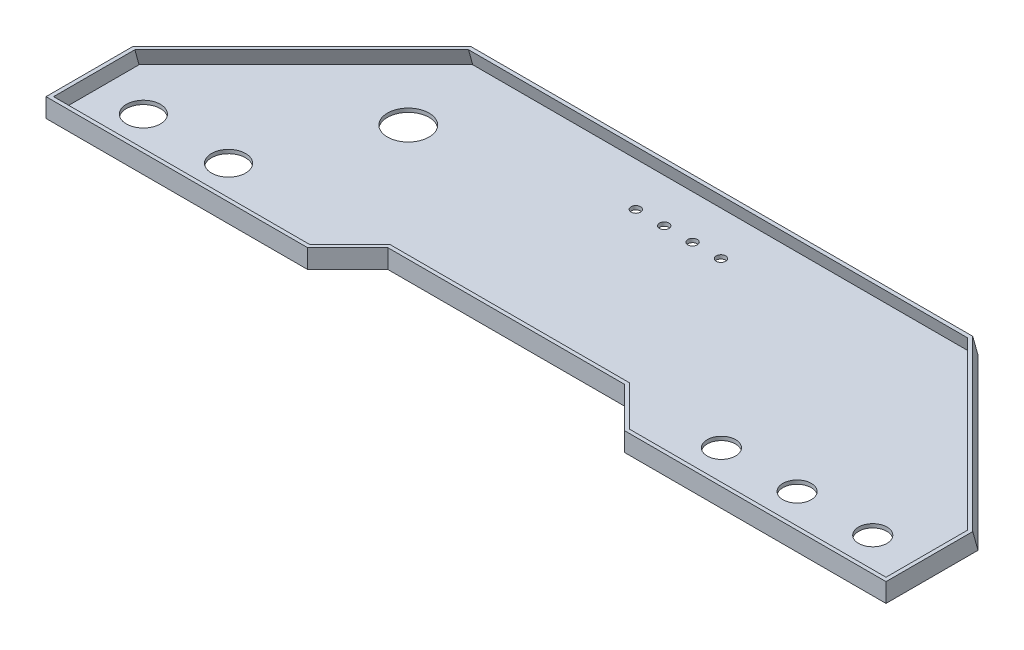
ISO-10303-21;
HEADER;
FILE_DESCRIPTION(('STEP AP214'),'2;1');
FILE_NAME('part.step','',(''),(''),'','','');
FILE_SCHEMA(('AUTOMOTIVE_DESIGN { 1 0 10303 214 1 1 1 1 }'));
ENDSEC;
DATA;
#1=APPLICATION_CONTEXT('core data for automotive mechanical design processes');
#2=APPLICATION_PROTOCOL_DEFINITION('international standard','automotive_design',2000,#1);
#3=PRODUCT_CONTEXT('',#1,'mechanical');
#4=PRODUCT('Part','Part','',(#3));
#5=PRODUCT_RELATED_PRODUCT_CATEGORY('part','',(#4));
#6=PRODUCT_DEFINITION_FORMATION('','',#4);
#7=PRODUCT_DEFINITION_CONTEXT('part definition',#1,'design');
#8=PRODUCT_DEFINITION('design','',#6,#7);
#9=PRODUCT_DEFINITION_SHAPE('','',#8);
#10=(LENGTH_UNIT() NAMED_UNIT(*) SI_UNIT(.MILLI.,.METRE.));
#11=(NAMED_UNIT(*) PLANE_ANGLE_UNIT() SI_UNIT($,.RADIAN.));
#12=(NAMED_UNIT(*) SI_UNIT($,.STERADIAN.) SOLID_ANGLE_UNIT());
#13=UNCERTAINTY_MEASURE_WITH_UNIT(LENGTH_MEASURE(1.E-05),#10,'distance_accuracy_value','');
#14=(GEOMETRIC_REPRESENTATION_CONTEXT(3) GLOBAL_UNCERTAINTY_ASSIGNED_CONTEXT((#13)) GLOBAL_UNIT_ASSIGNED_CONTEXT((#10,
#11,#12)) REPRESENTATION_CONTEXT('',''));
#15=CARTESIAN_POINT('',(0.,0.,0.));
#16=DIRECTION('',(0.,0.,1.));
#17=DIRECTION('',(1.,0.,0.));
#18=AXIS2_PLACEMENT_3D('',#15,#16,#17);
#19=CARTESIAN_POINT('',(0.,10.,0.));
#20=DIRECTION('',(0.,1.,0.));
#21=DIRECTION('',(0.,0.,1.));
#22=AXIS2_PLACEMENT_3D('',#19,#20,#21);
#23=PLANE('',#22);
#24=DIRECTION('',(1.,0.,0.));
#25=VECTOR('',#24,1.);
#26=CARTESIAN_POINT('',(0.,10.,142.));
#27=LINE('',#26,#25);
#28=CARTESIAN_POINT('',(-219.999999994777,10.,142.));
#29=VERTEX_POINT('',#28);
#30=CARTESIAN_POINT('',(-84.5269119206043,10.,142.));
#31=VERTEX_POINT('',#30);
#32=EDGE_CURVE('E236',#29,#31,#27,.T.);
#33=ORIENTED_EDGE('',*,*,#32,.F.);
#34=DIRECTION('',(0.,0.,1.));
#35=VECTOR('',#34,1.);
#36=CARTESIAN_POINT('',(-219.999999994777,10.,0.));
#37=LINE('',#36,#35);
#38=CARTESIAN_POINT('',(-219.999999994777,10.,99.0317101084428));
#39=VERTEX_POINT('',#38);
#40=EDGE_CURVE('E258',#39,#29,#37,.T.);
#41=ORIENTED_EDGE('',*,*,#40,.F.);
#42=DIRECTION('',(-0.707106781166289,0.,0.707106781206806));
#43=VECTOR('',#42,1.);
#44=CARTESIAN_POINT('',(-60.48414494947,10.,-60.4841449460043));
#45=LINE('',#44,#43);
#46=CARTESIAN_POINT('',(-131.820656156528,10.,10.8523662651414));
#47=VERTEX_POINT('',#46);
#48=EDGE_CURVE('E72',#47,#39,#45,.T.);
#49=ORIENTED_EDGE('',*,*,#48,.F.);
#50=DIRECTION('',(-1.,0.,0.));
#51=VECTOR('',#50,1.);
#52=CARTESIAN_POINT('',(0.,10.,10.8523662651414));
#53=LINE('',#52,#51);
#54=CARTESIAN_POINT('',(131.820656169937,10.,10.8523662651414));
#55=VERTEX_POINT('',#54);
#56=EDGE_CURVE('E255',#55,#47,#53,.T.);
#57=ORIENTED_EDGE('',*,*,#56,.F.);
#58=DIRECTION('',(-0.707106781186556,0.,-0.707106781186539));
#59=VECTOR('',#58,1.);
#60=CARTESIAN_POINT('',(60.4841449523962,10.,-60.4841449523977));
#61=LINE('',#60,#59);
#62=CARTESIAN_POINT('',(220.000000010123,10.,99.0317101053249));
#63=VERTEX_POINT('',#62);
#64=EDGE_CURVE('E218',#63,#55,#61,.T.);
#65=ORIENTED_EDGE('',*,*,#64,.F.);
#66=DIRECTION('',(0.,0.,-1.));
#67=VECTOR('',#66,1.);
#68=CARTESIAN_POINT('',(220.000000010123,10.,0.));
#69=LINE('',#68,#67);
#70=CARTESIAN_POINT('',(220.000000010123,10.,141.999999994878));
#71=VERTEX_POINT('',#70);
#72=EDGE_CURVE('E251',#71,#63,#69,.T.);
#73=ORIENTED_EDGE('',*,*,#72,.F.);
#74=DIRECTION('',(1.,0.,0.));
#75=VECTOR('',#74,1.);
#76=CARTESIAN_POINT('',(0.,10.,141.999999994878));
#77=LINE('',#76,#75);
#78=CARTESIAN_POINT('',(84.5269119413094,10.,141.999999994878));
#79=VERTEX_POINT('',#78);
#80=EDGE_CURVE('E248',#79,#71,#77,.T.);
#81=ORIENTED_EDGE('',*,*,#80,.F.);
#82=DIRECTION('',(0.707106780974023,0.,0.707106781399072));
#83=VECTOR('',#82,1.);
#84=CARTESIAN_POINT('',(-28.7365440013794,10.,28.7365439841055));
#85=LINE('',#84,#83);
#86=CARTESIAN_POINT('',(63.3137085094821,10.,120.786796550299));
#87=VERTEX_POINT('',#86);
#88=EDGE_CURVE('E245',#87,#79,#85,.T.);
#89=ORIENTED_EDGE('',*,*,#88,.F.);
#90=DIRECTION('',(1.,0.,-6.11336731652061E-11));
#91=VECTOR('',#90,1.);
#92=CARTESIAN_POINT('',(7.38414054321486E-09,10.,120.78679655417));
#93=LINE('',#92,#91);
#94=CARTESIAN_POINT('',(-63.3137084812384,10.,120.78679655804));
#95=VERTEX_POINT('',#94);
#96=EDGE_CURVE('E242',#95,#87,#93,.T.);
#97=ORIENTED_EDGE('',*,*,#96,.F.);
#98=DIRECTION('',(0.707106781143319,0.,-0.707106781229776));
#99=VECTOR('',#98,1.);
#100=CARTESIAN_POINT('',(28.7365440345304,10.,28.7365440310167));
#101=LINE('',#100,#99);
#102=EDGE_CURVE('E239',#31,#95,#101,.T.);
#103=ORIENTED_EDGE('',*,*,#102,.F.);
#104=EDGE_LOOP('',(#33,#41,#49,#57,#65,#73,#81,#89,#97,#103));
#105=FACE_BOUND('',#104,.T.);
#106=DIRECTION('',(1.,0.,0.));
#107=VECTOR('',#106,1.);
#108=CARTESIAN_POINT('',(-221.999999994777,10.,144.));
#109=LINE('',#108,#107);
#110=CARTESIAN_POINT('',(-221.999999994777,10.,144.));
#111=VERTEX_POINT('',#110);
#112=CARTESIAN_POINT('',(-83.6984847944896,10.,144.));
#113=VERTEX_POINT('',#112);
#114=EDGE_CURVE('E558',#111,#113,#109,.T.);
#115=ORIENTED_EDGE('',*,*,#114,.T.);
#116=DIRECTION('',(0.70710678110009,0.,-0.707106781273005));
#117=VECTOR('',#116,1.);
#118=CARTESIAN_POINT('',(-83.6984847944896,10.,144.));
#119=LINE('',#118,#117);
#120=CARTESIAN_POINT('',(-62.4852813614867,10.,122.78679656181));
#121=VERTEX_POINT('',#120);
#122=EDGE_CURVE('E549',#113,#121,#119,.T.);
#123=ORIENTED_EDGE('',*,*,#122,.T.);
#124=DIRECTION('',(1.,0.,-1.22267346330412E-10));
#125=VECTOR('',#124,1.);
#126=CARTESIAN_POINT('',(-62.4852813614867,10.,122.78679656181));
#127=LINE('',#126,#125);
#128=CARTESIAN_POINT('',(62.4852813869902,10.,122.78679654653));
#129=VERTEX_POINT('',#128);
#130=EDGE_CURVE('E540',#121,#129,#127,.T.);
#131=ORIENTED_EDGE('',*,*,#130,.T.);
#132=DIRECTION('',(0.707106780761499,0.,0.707106781611596));
#133=VECTOR('',#132,1.);
#134=CARTESIAN_POINT('',(62.4852813869902,10.,122.78679654653));
#135=LINE('',#134,#133);
#136=CARTESIAN_POINT('',(83.6984848098353,10.,143.999999994878));
#137=VERTEX_POINT('',#136);
#138=EDGE_CURVE('E532',#129,#137,#135,.T.);
#139=ORIENTED_EDGE('',*,*,#138,.T.);
#140=DIRECTION('',(1.,0.,0.));
#141=VECTOR('',#140,1.);
#142=CARTESIAN_POINT('',(83.6984848098353,10.,143.999999994878));
#143=LINE('',#142,#141);
#144=CARTESIAN_POINT('',(222.000000010123,10.,143.999999994878));
#145=VERTEX_POINT('',#144);
#146=EDGE_CURVE('E443',#137,#145,#143,.T.);
#147=ORIENTED_EDGE('',*,*,#146,.T.);
#148=DIRECTION('',(0.,0.,-1.));
#149=VECTOR('',#148,1.);
#150=CARTESIAN_POINT('',(222.000000010123,10.,143.999999994878));
#151=LINE('',#150,#149);
#152=CARTESIAN_POINT('',(222.000000010123,10.,98.1492802448776));
#153=VERTEX_POINT('',#152);
#154=EDGE_CURVE('E487',#145,#153,#151,.T.);
#155=ORIENTED_EDGE('',*,*,#154,.T.);
#156=DIRECTION('',(-0.707106781186556,0.,-0.707106781186539));
#157=VECTOR('',#156,1.);
#158=CARTESIAN_POINT('',(132.627417005112,10.,8.77669723986886));
#159=LINE('',#158,#157);
#160=CARTESIAN_POINT('',(132.627417005112,10.,8.77669723986886));
#161=VERTEX_POINT('',#160);
#162=EDGE_CURVE('E500',#153,#161,#159,.T.);
#163=ORIENTED_EDGE('',*,*,#162,.T.);
#164=DIRECTION('',(-1.,0.,0.));
#165=VECTOR('',#164,1.);
#166=CARTESIAN_POINT('',(132.627417005112,10.,8.77669723986886));
#167=LINE('',#166,#165);
#168=CARTESIAN_POINT('',(-132.627416994888,10.,8.77669723986889));
#169=VERTEX_POINT('',#168);
#170=EDGE_CURVE('E510',#161,#169,#167,.T.);
#171=ORIENTED_EDGE('',*,*,#170,.T.);
#172=DIRECTION('',(-0.707106781146031,0.,0.707106781227065));
#173=VECTOR('',#172,1.);
#174=CARTESIAN_POINT('',(-132.627416994888,10.,8.77669723986889));
#175=LINE('',#174,#173);
#176=CARTESIAN_POINT('',(-221.999999994777,10.,98.1492802499997));
#177=VERTEX_POINT('',#176);
#178=EDGE_CURVE('E64',#169,#177,#175,.T.);
#179=ORIENTED_EDGE('',*,*,#178,.T.);
#180=DIRECTION('',(0.,0.,1.));
#181=VECTOR('',#180,1.);
#182=CARTESIAN_POINT('',(-221.999999994777,10.,144.));
#183=LINE('',#182,#181);
#184=EDGE_CURVE('E12',#177,#111,#183,.T.);
#185=ORIENTED_EDGE('',*,*,#184,.T.);
#186=EDGE_LOOP('',(#115,#123,#131,#139,#147,#155,#163,#171,#179,#185));
#187=FACE_BOUND('',#186,.T.);
#188=ADVANCED_FACE('F55',(#105,#187),#23,.T.);
#189=CARTESIAN_POINT('',(0.,0.,0.));
#190=DIRECTION('',(0.,1.,0.));
#191=DIRECTION('',(0.,0.,1.));
#192=AXIS2_PLACEMENT_3D('',#189,#190,#191);
#193=PLANE('',#192);
#194=CARTESIAN_POINT('',(-151.259999994777,0.,118.26));
#195=DIRECTION('',(0.,-1.,0.));
#196=DIRECTION('',(0.,0.,-1.));
#197=AXIS2_PLACEMENT_3D('',#194,#195,#196);
#198=CIRCLE('',#197,9.00000000000001);
#199=CARTESIAN_POINT('',(-151.259999994777,0.,109.26));
#200=VERTEX_POINT('',#199);
#201=EDGE_CURVE('E909',#200,#200,#198,.T.);
#202=ORIENTED_EDGE('',*,*,#201,.F.);
#203=EDGE_LOOP('',(#202));
#204=FACE_BOUND('',#203,.T.);
#205=CARTESIAN_POINT('',(-196.259999994777,0.,118.26));
#206=DIRECTION('',(0.,-1.,0.));
#207=DIRECTION('',(0.,0.,-1.));
#208=AXIS2_PLACEMENT_3D('',#205,#206,#207);
#209=CIRCLE('',#208,9.00000000000001);
#210=CARTESIAN_POINT('',(-196.259999994777,0.,109.26));
#211=VERTEX_POINT('',#210);
#212=EDGE_CURVE('E911',#211,#211,#209,.T.);
#213=ORIENTED_EDGE('',*,*,#212,.F.);
#214=EDGE_LOOP('',(#213));
#215=FACE_BOUND('',#214,.T.);
#216=CARTESIAN_POINT('',(-121.259999994777,0.,53.2600000000001));
#217=DIRECTION('',(0.,-1.,0.));
#218=DIRECTION('',(0.,0.,-1.));
#219=AXIS2_PLACEMENT_3D('',#216,#217,#218);
#220=CIRCLE('',#219,11.);
#221=CARTESIAN_POINT('',(-121.259999994777,0.,42.2600000000001));
#222=VERTEX_POINT('',#221);
#223=EDGE_CURVE('E917',#222,#222,#220,.T.);
#224=ORIENTED_EDGE('',*,*,#223,.F.);
#225=EDGE_LOOP('',(#224));
#226=FACE_BOUND('',#225,.T.);
#227=CARTESIAN_POINT('',(109.259999994777,0.,118.26));
#228=DIRECTION('',(0.,-1.,0.));
#229=DIRECTION('',(0.,0.,-1.));
#230=AXIS2_PLACEMENT_3D('',#227,#228,#229);
#231=CIRCLE('',#230,7.50000000000001);
#232=CARTESIAN_POINT('',(109.259999994777,0.,110.76));
#233=VERTEX_POINT('',#232);
#234=EDGE_CURVE('E910',#233,#233,#231,.T.);
#235=ORIENTED_EDGE('',*,*,#234,.F.);
#236=EDGE_LOOP('',(#235));
#237=FACE_BOUND('',#236,.T.);
#238=CARTESIAN_POINT('',(149.259999994777,0.,118.26));
#239=DIRECTION('',(0.,-1.,0.));
#240=DIRECTION('',(0.,0.,-1.));
#241=AXIS2_PLACEMENT_3D('',#238,#239,#240);
#242=CIRCLE('',#241,7.50000000000001);
#243=CARTESIAN_POINT('',(149.259999994777,0.,110.76));
#244=VERTEX_POINT('',#243);
#245=EDGE_CURVE('E914',#244,#244,#242,.T.);
#246=ORIENTED_EDGE('',*,*,#245,.F.);
#247=EDGE_LOOP('',(#246));
#248=FACE_BOUND('',#247,.T.);
#249=CARTESIAN_POINT('',(7.5,0.,31.74));
#250=DIRECTION('',(0.,-1.,0.));
#251=DIRECTION('',(0.,0.,-1.));
#252=AXIS2_PLACEMENT_3D('',#249,#250,#251);
#253=CIRCLE('',#252,2.5);
#254=CARTESIAN_POINT('',(7.5,0.,29.24));
#255=VERTEX_POINT('',#254);
#256=EDGE_CURVE('E579',#255,#255,#253,.T.);
#257=ORIENTED_EDGE('',*,*,#256,.F.);
#258=EDGE_LOOP('',(#257));
#259=FACE_BOUND('',#258,.T.);
#260=CARTESIAN_POINT('',(-7.5,0.,31.74));
#261=DIRECTION('',(0.,-1.,0.));
#262=DIRECTION('',(0.,0.,-1.));
#263=AXIS2_PLACEMENT_3D('',#260,#261,#262);
#264=CIRCLE('',#263,2.5);
#265=CARTESIAN_POINT('',(-7.5,0.,29.24));
#266=VERTEX_POINT('',#265);
#267=EDGE_CURVE('E609',#266,#266,#264,.T.);
#268=ORIENTED_EDGE('',*,*,#267,.F.);
#269=EDGE_LOOP('',(#268));
#270=FACE_BOUND('',#269,.T.);
#271=CARTESIAN_POINT('',(-22.5,0.,31.74));
#272=DIRECTION('',(0.,-1.,0.));
#273=DIRECTION('',(0.,0.,-1.));
#274=AXIS2_PLACEMENT_3D('',#271,#272,#273);
#275=CIRCLE('',#274,2.5);
#276=CARTESIAN_POINT('',(-22.5,0.,29.24));
#277=VERTEX_POINT('',#276);
#278=EDGE_CURVE('E921',#277,#277,#275,.T.);
#279=ORIENTED_EDGE('',*,*,#278,.F.);
#280=EDGE_LOOP('',(#279));
#281=FACE_BOUND('',#280,.T.);
#282=CARTESIAN_POINT('',(189.259999994777,0.,118.26));
#283=DIRECTION('',(0.,-1.,0.));
#284=DIRECTION('',(0.,0.,-1.));
#285=AXIS2_PLACEMENT_3D('',#282,#283,#284);
#286=CIRCLE('',#285,7.50000000000001);
#287=CARTESIAN_POINT('',(189.259999994777,0.,110.76));
#288=VERTEX_POINT('',#287);
#289=EDGE_CURVE('E924',#288,#288,#286,.T.);
#290=ORIENTED_EDGE('',*,*,#289,.F.);
#291=EDGE_LOOP('',(#290));
#292=FACE_BOUND('',#291,.T.);
#293=CARTESIAN_POINT('',(22.5,0.,31.74));
#294=DIRECTION('',(0.,-1.,0.));
#295=DIRECTION('',(0.,0.,-1.));
#296=AXIS2_PLACEMENT_3D('',#293,#294,#295);
#297=CIRCLE('',#296,2.5);
#298=CARTESIAN_POINT('',(22.5,0.,29.24));
#299=VERTEX_POINT('',#298);
#300=EDGE_CURVE('E574',#299,#299,#297,.T.);
#301=ORIENTED_EDGE('',*,*,#300,.F.);
#302=EDGE_LOOP('',(#301));
#303=FACE_BOUND('',#302,.T.);
#304=DIRECTION('',(-0.707106781186548,0.,0.707106781186547));
#305=VECTOR('',#304,1.);
#306=CARTESIAN_POINT('',(-132.627416995761,0.,6.));
#307=LINE('',#306,#305);
#308=CARTESIAN_POINT('',(-132.627416995761,0.,6.));
#309=VERTEX_POINT('',#308);
#310=CARTESIAN_POINT('',(-221.999999994777,0.,95.3725829990155));
#311=VERTEX_POINT('',#310);
#312=EDGE_CURVE('E260',#309,#311,#307,.T.);
#313=ORIENTED_EDGE('',*,*,#312,.F.);
#314=DIRECTION('',(-1.,0.,0.));
#315=VECTOR('',#314,1.);
#316=CARTESIAN_POINT('',(-132.627416995761,0.,6.));
#317=LINE('',#316,#315);
#318=CARTESIAN_POINT('',(132.627416995761,0.,6.));
#319=VERTEX_POINT('',#318);
#320=EDGE_CURVE('E266',#319,#309,#317,.T.);
#321=ORIENTED_EDGE('',*,*,#320,.F.);
#322=DIRECTION('',(-0.707106781186548,0.,-0.707106781186548));
#323=VECTOR('',#322,1.);
#324=CARTESIAN_POINT('',(132.627416995761,0.,6.));
#325=LINE('',#324,#323);
#326=CARTESIAN_POINT('',(221.999999994777,0.,95.3725829990155));
#327=VERTEX_POINT('',#326);
#328=EDGE_CURVE('E317',#327,#319,#325,.T.);
#329=ORIENTED_EDGE('',*,*,#328,.F.);
#330=DIRECTION('',(0.,0.,-1.));
#331=VECTOR('',#330,1.);
#332=CARTESIAN_POINT('',(221.999999994777,0.,95.3725829990155));
#333=LINE('',#332,#331);
#334=CARTESIAN_POINT('',(221.999999994777,0.,144.));
#335=VERTEX_POINT('',#334);
#336=EDGE_CURVE('E422',#335,#327,#333,.T.);
#337=ORIENTED_EDGE('',*,*,#336,.F.);
#338=DIRECTION('',(1.,0.,0.));
#339=VECTOR('',#338,1.);
#340=CARTESIAN_POINT('',(83.6984848098349,0.,144.));
#341=LINE('',#340,#339);
#342=CARTESIAN_POINT('',(83.6984848098349,0.,144.));
#343=VERTEX_POINT('',#342);
#344=EDGE_CURVE('E418',#343,#335,#341,.T.);
#345=ORIENTED_EDGE('',*,*,#344,.F.);
#346=DIRECTION('',(0.707106781186547,0.,0.707106781186548));
#347=VECTOR('',#346,1.);
#348=CARTESIAN_POINT('',(62.4852813742385,0.,122.786796564404));
#349=LINE('',#348,#347);
#350=CARTESIAN_POINT('',(62.4852813742385,0.,122.786796564404));
#351=VERTEX_POINT('',#350);
#352=EDGE_CURVE('E414',#351,#343,#349,.T.);
#353=ORIENTED_EDGE('',*,*,#352,.F.);
#354=DIRECTION('',(1.,0.,0.));
#355=VECTOR('',#354,1.);
#356=CARTESIAN_POINT('',(-62.4852813742385,0.,122.786796564404));
#357=LINE('',#356,#355);
#358=CARTESIAN_POINT('',(-62.4852813742385,0.,122.786796564404));
#359=VERTEX_POINT('',#358);
#360=EDGE_CURVE('E410',#359,#351,#357,.T.);
#361=ORIENTED_EDGE('',*,*,#360,.F.);
#362=DIRECTION('',(0.707106781186547,0.,-0.707106781186547));
#363=VECTOR('',#362,1.);
#364=CARTESIAN_POINT('',(-83.6984848098351,0.,144.));
#365=LINE('',#364,#363);
#366=CARTESIAN_POINT('',(-83.6984848098351,0.,144.));
#367=VERTEX_POINT('',#366);
#368=EDGE_CURVE('E406',#367,#359,#365,.T.);
#369=ORIENTED_EDGE('',*,*,#368,.F.);
#370=DIRECTION('',(1.,0.,0.));
#371=VECTOR('',#370,1.);
#372=CARTESIAN_POINT('',(-221.999999994777,0.,144.));
#373=LINE('',#372,#371);
#374=CARTESIAN_POINT('',(-221.999999994777,0.,144.));
#375=VERTEX_POINT('',#374);
#376=EDGE_CURVE('E403',#375,#367,#373,.T.);
#377=ORIENTED_EDGE('',*,*,#376,.F.);
#378=DIRECTION('',(0.,0.,1.));
#379=VECTOR('',#378,1.);
#380=CARTESIAN_POINT('',(-221.999999994777,0.,95.3725829990155));
#381=LINE('',#380,#379);
#382=EDGE_CURVE('E395',#311,#375,#381,.T.);
#383=ORIENTED_EDGE('',*,*,#382,.F.);
#384=EDGE_LOOP('',(#313,#321,#329,#337,#345,#353,#361,#369,#377,#383));
#385=FACE_BOUND('',#384,.T.);
#386=ADVANCED_FACE('F330',(#204,#215,#226,#237,#248,#259,#270,#281,#292,#303,#385),#193,.F.);
#387=CARTESIAN_POINT('',(0.,0.,144.));
#388=DIRECTION('',(0.,0.,-1.));
#389=DIRECTION('',(-1.,0.,0.));
#390=AXIS2_PLACEMENT_3D('',#387,#388,#389);
#391=PLANE('',#390);
#392=DIRECTION('',(1.53454471352177E-09,1.,0.));
#393=VECTOR('',#392,1.);
#394=CARTESIAN_POINT('',(-83.6984848098351,0.,144.));
#395=LINE('',#394,#393);
#396=EDGE_CURVE('E316',#367,#113,#395,.T.);
#397=ORIENTED_EDGE('',*,*,#396,.T.);
#398=ORIENTED_EDGE('',*,*,#114,.F.);
#399=DIRECTION('',(0.,1.,0.));
#400=VECTOR('',#399,1.);
#401=CARTESIAN_POINT('',(-221.999999994777,0.,144.));
#402=LINE('',#401,#400);
#403=EDGE_CURVE('E1010',#375,#111,#402,.T.);
#404=ORIENTED_EDGE('',*,*,#403,.F.);
#405=ORIENTED_EDGE('',*,*,#376,.T.);
#406=EDGE_LOOP('',(#397,#398,#404,#405));
#407=FACE_BOUND('',#406,.T.);
#408=ADVANCED_FACE('F340',(#407),#391,.F.);
#409=CARTESIAN_POINT('',(-221.999999994777,0.,0.));
#410=DIRECTION('',(1.,0.,0.));
#411=DIRECTION('',(0.,0.,-1.));
#412=AXIS2_PLACEMENT_3D('',#409,#410,#411);
#413=PLANE('',#412);
#414=ORIENTED_EDGE('',*,*,#403,.T.);
#415=ORIENTED_EDGE('',*,*,#184,.F.);
#416=DIRECTION('',(0.,0.963544753559307,0.267547206840838));
#417=VECTOR('',#416,1.);
#418=CARTESIAN_POINT('',(-221.999999994777,0.,95.3725829990155));
#419=LINE('',#418,#417);
#420=EDGE_CURVE('E1003',#311,#177,#419,.T.);
#421=ORIENTED_EDGE('',*,*,#420,.F.);
#422=ORIENTED_EDGE('',*,*,#382,.T.);
#423=EDGE_LOOP('',(#414,#415,#421,#422));
#424=FACE_BOUND('',#423,.T.);
#425=ADVANCED_FACE('F685',(#424),#413,.F.);
#426=CARTESIAN_POINT('',(-73.0918830920368,0.,133.393398282202));
#427=DIRECTION('',(0.707106781229776,-9.01682510317122E-10,0.707106781143319));
#428=DIRECTION('',(0.707106781143319,0.,-0.707106781229776));
#429=AXIS2_PLACEMENT_3D('',#426,#427,#428);
#430=PLANE('',#429);
#431=DIRECTION('',(1.27517371661945E-09,1.,-2.59374466349271E-10));
#432=VECTOR('',#431,1.);
#433=CARTESIAN_POINT('',(-62.4852813742385,0.,122.786796564404));
#434=LINE('',#433,#432);
#435=EDGE_CURVE('E449',#359,#121,#434,.T.);
#436=ORIENTED_EDGE('',*,*,#435,.T.);
#437=ORIENTED_EDGE('',*,*,#122,.F.);
#438=ORIENTED_EDGE('',*,*,#396,.F.);
#439=ORIENTED_EDGE('',*,*,#368,.T.);
#440=EDGE_LOOP('',(#436,#437,#438,#439));
#441=FACE_BOUND('',#440,.T.);
#442=ADVANCED_FACE('F692',(#441),#430,.T.);
#443=CARTESIAN_POINT('',(0.,0.,122.786796564404));
#444=DIRECTION('',(6.11336731652061E-11,1.02336542010504E-09,1.));
#445=DIRECTION('',(0.,-1.,1.02336542010504E-09));
#446=AXIS2_PLACEMENT_3D('',#443,#444,#445);
#447=PLANE('',#446);
#448=DIRECTION('',(1.27517371661945E-09,1.,-1.78735637401672E-09));
#449=VECTOR('',#448,1.);
#450=CARTESIAN_POINT('',(62.4852813742385,0.,122.786796564404));
#451=LINE('',#450,#449);
#452=EDGE_CURVE('E438',#351,#129,#451,.T.);
#453=ORIENTED_EDGE('',*,*,#452,.T.);
#454=ORIENTED_EDGE('',*,*,#130,.F.);
#455=ORIENTED_EDGE('',*,*,#435,.F.);
#456=ORIENTED_EDGE('',*,*,#360,.T.);
#457=EDGE_LOOP('',(#453,#454,#455,#456));
#458=FACE_BOUND('',#457,.T.);
#459=ADVANCED_FACE('F699',(#458),#447,.T.);
#460=CARTESIAN_POINT('',(62.4852813806143,5.,122.786796555467));
#461=DIRECTION('',(-0.707106781399072,1.26387315579974E-09,0.707106780974023));
#462=DIRECTION('',(0.707106780974023,0.,0.707106781399072));
#463=AXIS2_PLACEMENT_3D('',#460,#461,#462);
#464=PLANE('',#463);
#465=DIRECTION('',(0.,1.,-5.12201392410816E-10));
#466=VECTOR('',#465,1.);
#467=CARTESIAN_POINT('',(83.6984848098349,0.,144.));
#468=LINE('',#467,#466);
#469=EDGE_CURVE('E435',#343,#137,#468,.T.);
#470=ORIENTED_EDGE('',*,*,#469,.T.);
#471=ORIENTED_EDGE('',*,*,#138,.F.);
#472=ORIENTED_EDGE('',*,*,#452,.F.);
#473=ORIENTED_EDGE('',*,*,#352,.T.);
#474=EDGE_LOOP('',(#470,#471,#472,#473));
#475=FACE_BOUND('',#474,.T.);
#476=ADVANCED_FACE('F434',(#475),#464,.T.);
#477=CARTESIAN_POINT('',(0.,7.37574001874463E-08,144.));
#478=DIRECTION('',(0.,-5.12204167968377E-10,-1.));
#479=DIRECTION('',(0.,1.,-5.12204167968377E-10));
#480=AXIS2_PLACEMENT_3D('',#477,#478,#479);
#481=PLANE('',#480);
#482=DIRECTION('',(1.53457246909738E-09,1.,-5.12204167968378E-10));
#483=VECTOR('',#482,1.);
#484=CARTESIAN_POINT('',(221.999999994777,0.,144.));
#485=LINE('',#484,#483);
#486=EDGE_CURVE('E445',#335,#145,#485,.T.);
#487=ORIENTED_EDGE('',*,*,#486,.T.);
#488=ORIENTED_EDGE('',*,*,#146,.F.);
#489=ORIENTED_EDGE('',*,*,#469,.F.);
#490=ORIENTED_EDGE('',*,*,#344,.T.);
#491=EDGE_LOOP('',(#487,#488,#489,#490));
#492=FACE_BOUND('',#491,.T.);
#493=ADVANCED_FACE('F441',(#492),#481,.F.);
#494=CARTESIAN_POINT('',(221.999999994777,-3.40675088131604E-07,0.));
#495=DIRECTION('',(-1.,1.53457246909738E-09,0.));
#496=DIRECTION('',(-1.53457246909738E-09,-1.,0.));
#497=AXIS2_PLACEMENT_3D('',#494,#495,#496);
#498=PLANE('',#497);
#499=DIRECTION('',(1.47862925175058E-09,0.96354475368654,0.267547206382623));
#500=VECTOR('',#499,1.);
#501=CARTESIAN_POINT('',(221.999999994777,0.,95.3725829990155));
#502=LINE('',#501,#500);
#503=EDGE_CURVE('E447',#327,#153,#502,.T.);
#504=ORIENTED_EDGE('',*,*,#503,.T.);
#505=ORIENTED_EDGE('',*,*,#154,.F.);
#506=ORIENTED_EDGE('',*,*,#486,.F.);
#507=ORIENTED_EDGE('',*,*,#336,.T.);
#508=EDGE_LOOP('',(#504,#505,#506,#507));
#509=FACE_BOUND('',#508,.T.);
#510=ADVANCED_FACE('F468',(#509),#498,.F.);
#511=CARTESIAN_POINT('',(60.9635491945477,16.927731821108,-60.9635491945491));
#512=DIRECTION('',(-0.693859034505544,-0.19266364594818,0.693859034505561));
#513=DIRECTION('',(0.707106781186556,0.,0.707106781186539));
#514=AXIS2_PLACEMENT_3D('',#511,#512,#513);
#515=PLANE('',#514);
#516=DIRECTION('',(9.00953786162305E-10,0.963544753835408,0.26754720584649));
#517=VECTOR('',#516,1.);
#518=CARTESIAN_POINT('',(132.627416995761,0.,6.));
#519=LINE('',#518,#517);
#520=EDGE_CURVE('E272',#319,#161,#519,.T.);
#521=ORIENTED_EDGE('',*,*,#520,.T.);
#522=ORIENTED_EDGE('',*,*,#162,.F.);
#523=ORIENTED_EDGE('',*,*,#503,.F.);
#524=ORIENTED_EDGE('',*,*,#328,.T.);
#525=EDGE_LOOP('',(#521,#522,#523,#524));
#526=FACE_BOUND('',#525,.T.);
#527=ADVANCED_FACE('F284',(#526),#515,.F.);
#528=CARTESIAN_POINT('',(0.,-1.54676223958025,5.57051095586239));
#529=DIRECTION('',(0.,-0.267547205846492,0.963544753835407));
#530=DIRECTION('',(0.,-0.963544753835407,-0.267547205846492));
#531=AXIS2_PLACEMENT_3D('',#528,#529,#530);
#532=PLANE('',#531);
#533=DIRECTION('',(8.41411525042401E-11,0.963544753835407,0.267547205846492));
#534=VECTOR('',#533,1.);
#535=CARTESIAN_POINT('',(-132.627416995761,0.,6.));
#536=LINE('',#535,#534);
#537=EDGE_CURVE('E1005',#309,#169,#536,.T.);
#538=ORIENTED_EDGE('',*,*,#537,.T.);
#539=ORIENTED_EDGE('',*,*,#170,.F.);
#540=ORIENTED_EDGE('',*,*,#520,.F.);
#541=ORIENTED_EDGE('',*,*,#320,.T.);
#542=EDGE_LOOP('',(#538,#539,#540,#541));
#543=FACE_BOUND('',#542,.T.);
#544=ADVANCED_FACE('F274',(#543),#532,.F.);
#545=CARTESIAN_POINT('',(-177.313708495269,0.,50.6862914995078));
#546=DIRECTION('',(-0.693859034383838,0.192663646968048,-0.69385903434408));
#547=DIRECTION('',(-0.707106781166289,0.,0.707106781206806));
#548=AXIS2_PLACEMENT_3D('',#545,#546,#547);
#549=PLANE('',#548);
#550=ORIENTED_EDGE('',*,*,#420,.T.);
#551=ORIENTED_EDGE('',*,*,#178,.F.);
#552=ORIENTED_EDGE('',*,*,#537,.F.);
#553=ORIENTED_EDGE('',*,*,#312,.T.);
#554=EDGE_LOOP('',(#550,#551,#552,#553));
#555=FACE_BOUND('',#554,.T.);
#556=ADVANCED_FACE('F283',(#555),#549,.T.);
#557=CARTESIAN_POINT('',(0.,2.,0.));
#558=DIRECTION('',(0.,1.,0.));
#559=DIRECTION('',(0.,0.,1.));
#560=AXIS2_PLACEMENT_3D('',#557,#558,#559);
#561=PLANE('',#560);
#562=CARTESIAN_POINT('',(-151.259999994777,2.,118.26));
#563=DIRECTION('',(0.,1.,0.));
#564=DIRECTION('',(0.,0.,1.));
#565=AXIS2_PLACEMENT_3D('',#562,#563,#564);
#566=CIRCLE('',#565,9.00000000000001);
#567=CARTESIAN_POINT('',(-151.259999994777,2.,127.26));
#568=VERTEX_POINT('',#567);
#569=EDGE_CURVE('E59',#568,#568,#566,.T.);
#570=ORIENTED_EDGE('',*,*,#569,.F.);
#571=EDGE_LOOP('',(#570));
#572=FACE_BOUND('',#571,.T.);
#573=CARTESIAN_POINT('',(-196.259999994777,2.,118.26));
#574=DIRECTION('',(0.,1.,0.));
#575=DIRECTION('',(0.,0.,1.));
#576=AXIS2_PLACEMENT_3D('',#573,#574,#575);
#577=CIRCLE('',#576,9.00000000000001);
#578=CARTESIAN_POINT('',(-196.259999994777,2.,127.26));
#579=VERTEX_POINT('',#578);
#580=EDGE_CURVE('E596',#579,#579,#577,.T.);
#581=ORIENTED_EDGE('',*,*,#580,.F.);
#582=EDGE_LOOP('',(#581));
#583=FACE_BOUND('',#582,.T.);
#584=CARTESIAN_POINT('',(-121.259999994777,2.,53.2600000000001));
#585=DIRECTION('',(0.,1.,0.));
#586=DIRECTION('',(0.,0.,1.));
#587=AXIS2_PLACEMENT_3D('',#584,#585,#586);
#588=CIRCLE('',#587,11.);
#589=CARTESIAN_POINT('',(-121.259999994777,2.,64.2600000000001));
#590=VERTEX_POINT('',#589);
#591=EDGE_CURVE('E594',#590,#590,#588,.T.);
#592=ORIENTED_EDGE('',*,*,#591,.F.);
#593=EDGE_LOOP('',(#592));
#594=FACE_BOUND('',#593,.T.);
#595=CARTESIAN_POINT('',(109.259999994777,2.,118.26));
#596=DIRECTION('',(0.,1.,0.));
#597=DIRECTION('',(0.,0.,1.));
#598=AXIS2_PLACEMENT_3D('',#595,#596,#597);
#599=CIRCLE('',#598,7.50000000000001);
#600=CARTESIAN_POINT('',(109.259999994777,2.,125.76));
#601=VERTEX_POINT('',#600);
#602=EDGE_CURVE('E591',#601,#601,#599,.T.);
#603=ORIENTED_EDGE('',*,*,#602,.F.);
#604=EDGE_LOOP('',(#603));
#605=FACE_BOUND('',#604,.T.);
#606=CARTESIAN_POINT('',(149.259999994777,2.,118.26));
#607=DIRECTION('',(0.,1.,0.));
#608=DIRECTION('',(0.,0.,1.));
#609=AXIS2_PLACEMENT_3D('',#606,#607,#608);
#610=CIRCLE('',#609,7.50000000000001);
#611=CARTESIAN_POINT('',(149.259999994777,2.,125.76));
#612=VERTEX_POINT('',#611);
#613=EDGE_CURVE('E588',#612,#612,#610,.T.);
#614=ORIENTED_EDGE('',*,*,#613,.F.);
#615=EDGE_LOOP('',(#614));
#616=FACE_BOUND('',#615,.T.);
#617=CARTESIAN_POINT('',(7.5,2.,31.74));
#618=DIRECTION('',(0.,1.,0.));
#619=DIRECTION('',(0.,0.,1.));
#620=AXIS2_PLACEMENT_3D('',#617,#618,#619);
#621=CIRCLE('',#620,2.5);
#622=CARTESIAN_POINT('',(7.5,2.,34.24));
#623=VERTEX_POINT('',#622);
#624=EDGE_CURVE('E585',#623,#623,#621,.T.);
#625=ORIENTED_EDGE('',*,*,#624,.F.);
#626=EDGE_LOOP('',(#625));
#627=FACE_BOUND('',#626,.T.);
#628=CARTESIAN_POINT('',(-7.5,2.,31.74));
#629=DIRECTION('',(0.,1.,0.));
#630=DIRECTION('',(0.,0.,1.));
#631=AXIS2_PLACEMENT_3D('',#628,#629,#630);
#632=CIRCLE('',#631,2.5);
#633=CARTESIAN_POINT('',(-7.5,2.,34.24));
#634=VERTEX_POINT('',#633);
#635=EDGE_CURVE('E582',#634,#634,#632,.T.);
#636=ORIENTED_EDGE('',*,*,#635,.F.);
#637=EDGE_LOOP('',(#636));
#638=FACE_BOUND('',#637,.T.);
#639=CARTESIAN_POINT('',(-22.5,2.,31.74));
#640=DIRECTION('',(0.,1.,0.));
#641=DIRECTION('',(0.,0.,1.));
#642=AXIS2_PLACEMENT_3D('',#639,#640,#641);
#643=CIRCLE('',#642,2.5);
#644=CARTESIAN_POINT('',(-22.5,2.,34.24));
#645=VERTEX_POINT('',#644);
#646=EDGE_CURVE('E578',#645,#645,#643,.T.);
#647=ORIENTED_EDGE('',*,*,#646,.F.);
#648=EDGE_LOOP('',(#647));
#649=FACE_BOUND('',#648,.T.);
#650=CARTESIAN_POINT('',(189.259999994777,2.,118.26));
#651=DIRECTION('',(0.,1.,0.));
#652=DIRECTION('',(0.,0.,1.));
#653=AXIS2_PLACEMENT_3D('',#650,#651,#652);
#654=CIRCLE('',#653,7.50000000000001);
#655=CARTESIAN_POINT('',(189.259999994777,2.,125.76));
#656=VERTEX_POINT('',#655);
#657=EDGE_CURVE('E575',#656,#656,#654,.T.);
#658=ORIENTED_EDGE('',*,*,#657,.F.);
#659=EDGE_LOOP('',(#658));
#660=FACE_BOUND('',#659,.T.);
#661=CARTESIAN_POINT('',(22.5,2.,31.74));
#662=DIRECTION('',(0.,1.,0.));
#663=DIRECTION('',(0.,0.,1.));
#664=AXIS2_PLACEMENT_3D('',#661,#662,#663);
#665=CIRCLE('',#664,2.5);
#666=CARTESIAN_POINT('',(22.5,2.,34.24));
#667=VERTEX_POINT('',#666);
#668=EDGE_CURVE('E565',#667,#667,#665,.T.);
#669=ORIENTED_EDGE('',*,*,#668,.F.);
#670=EDGE_LOOP('',(#669));
#671=FACE_BOUND('',#670,.T.);
#672=DIRECTION('',(-0.707106781166289,0.,0.707106781206806));
#673=VECTOR('',#672,1.);
#674=CARTESIAN_POINT('',(-61.5948238478153,2.,-61.5948238442859));
#675=LINE('',#674,#673);
#676=CARTESIAN_POINT('',(-131.820656161324,2.,8.63100847324631));
#677=VERTEX_POINT('',#676);
#678=CARTESIAN_POINT('',(-219.999999994777,2.,96.8103523117522));
#679=VERTEX_POINT('',#678);
#680=EDGE_CURVE('E573',#677,#679,#675,.T.);
#681=ORIENTED_EDGE('',*,*,#680,.T.);
#682=DIRECTION('',(0.,0.,1.));
#683=VECTOR('',#682,1.);
#684=CARTESIAN_POINT('',(-219.999999994777,2.,0.));
#685=LINE('',#684,#683);
#686=CARTESIAN_POINT('',(-219.999999994777,2.,142.));
#687=VERTEX_POINT('',#686);
#688=EDGE_CURVE('E611',#679,#687,#685,.T.);
#689=ORIENTED_EDGE('',*,*,#688,.T.);
#690=DIRECTION('',(1.,0.,0.));
#691=VECTOR('',#690,1.);
#692=CARTESIAN_POINT('',(0.,2.,142.));
#693=LINE('',#692,#691);
#694=CARTESIAN_POINT('',(-84.5269119308056,2.,142.));
#695=VERTEX_POINT('',#694);
#696=EDGE_CURVE('E625',#687,#695,#693,.T.);
#697=ORIENTED_EDGE('',*,*,#696,.T.);
#698=DIRECTION('',(0.707106781143319,0.,-0.707106781229776));
#699=VECTOR('',#698,1.);
#700=CARTESIAN_POINT('',(28.7365440294297,2.,28.7365440259161));
#701=LINE('',#700,#699);
#702=CARTESIAN_POINT('',(-63.3137084996267,2.,120.786796566227));
#703=VERTEX_POINT('',#702);
#704=EDGE_CURVE('E622',#695,#703,#701,.T.);
#705=ORIENTED_EDGE('',*,*,#704,.T.);
#706=DIRECTION('',(1.,0.,-6.11336731652061E-11));
#707=VECTOR('',#706,1.);
#708=CARTESIAN_POINT('',(7.38414054371535E-09,2.,120.786796562357));
#709=LINE('',#708,#707);
#710=CARTESIAN_POINT('',(63.3137085033699,2.,120.786796558486));
#711=VERTEX_POINT('',#710);
#712=EDGE_CURVE('E619',#703,#711,#709,.T.);
#713=ORIENTED_EDGE('',*,*,#712,.T.);
#714=DIRECTION('',(0.707106780974023,0.,0.707106781399072));
#715=VECTOR('',#714,1.);
#716=CARTESIAN_POINT('',(-28.7365440085289,2.,28.7365439912551));
#717=LINE('',#716,#715);
#718=CARTESIAN_POINT('',(84.5269119311079,2.,141.999999998976));
#719=VERTEX_POINT('',#718);
#720=EDGE_CURVE('E616',#711,#719,#717,.T.);
#721=ORIENTED_EDGE('',*,*,#720,.T.);
#722=DIRECTION('',(1.,0.,0.));
#723=VECTOR('',#722,1.);
#724=CARTESIAN_POINT('',(0.,2.,141.999999998976));
#725=LINE('',#724,#723);
#726=CARTESIAN_POINT('',(219.999999997846,2.,141.999999998976));
#727=VERTEX_POINT('',#726);
#728=EDGE_CURVE('E614',#719,#727,#725,.T.);
#729=ORIENTED_EDGE('',*,*,#728,.T.);
#730=DIRECTION('',(0.,0.,-1.));
#731=VECTOR('',#730,1.);
#732=CARTESIAN_POINT('',(219.999999997846,2.,0.));
#733=LINE('',#732,#731);
#734=CARTESIAN_POINT('',(219.999999997846,2.,96.8103523086336));
#735=VERTEX_POINT('',#734);
#736=EDGE_CURVE('E212',#727,#735,#733,.T.);
#737=ORIENTED_EDGE('',*,*,#736,.T.);
#738=DIRECTION('',(-0.707106781186556,0.,-0.707106781186539));
#739=VECTOR('',#738,1.);
#740=CARTESIAN_POINT('',(61.5948238446036,2.,-61.5948238446051));
#741=LINE('',#740,#739);
#742=CARTESIAN_POINT('',(131.820656162457,2.,8.63100847324628));
#743=VERTEX_POINT('',#742);
#744=EDGE_CURVE('E207',#735,#743,#741,.T.);
#745=ORIENTED_EDGE('',*,*,#744,.T.);
#746=DIRECTION('',(-1.,0.,0.));
#747=VECTOR('',#746,1.);
#748=CARTESIAN_POINT('',(0.,2.,8.63100847324629));
#749=LINE('',#748,#747);
#750=EDGE_CURVE('E195',#743,#677,#749,.T.);
#751=ORIENTED_EDGE('',*,*,#750,.T.);
#752=EDGE_LOOP('',(#681,#689,#697,#705,#713,#721,#729,#737,#745,#751));
#753=FACE_BOUND('',#752,.T.);
#754=ADVANCED_FACE('F210',(#572,#583,#594,#605,#616,#627,#638,#649,#660,#671,#753),#561,.T.);
#755=CARTESIAN_POINT('',(0.,0.,142.));
#756=DIRECTION('',(0.,0.,-1.));
#757=DIRECTION('',(-1.,0.,0.));
#758=AXIS2_PLACEMENT_3D('',#755,#756,#757);
#759=PLANE('',#758);
#760=DIRECTION('',(1.27517163496713E-09,1.,0.));
#761=VECTOR('',#760,1.);
#762=CARTESIAN_POINT('',(-84.526911933356,1.45816244234814E-08,142.));
#763=LINE('',#762,#761);
#764=EDGE_CURVE('E206',#695,#31,#763,.T.);
#765=ORIENTED_EDGE('',*,*,#764,.F.);
#766=ORIENTED_EDGE('',*,*,#696,.F.);
#767=DIRECTION('',(0.,1.,0.));
#768=VECTOR('',#767,1.);
#769=CARTESIAN_POINT('',(-219.999999994777,0.,142.));
#770=LINE('',#769,#768);
#771=EDGE_CURVE('E235',#687,#29,#770,.T.);
#772=ORIENTED_EDGE('',*,*,#771,.T.);
#773=ORIENTED_EDGE('',*,*,#32,.T.);
#774=EDGE_LOOP('',(#765,#766,#772,#773));
#775=FACE_BOUND('',#774,.T.);
#776=ADVANCED_FACE('F642',(#775),#759,.T.);
#777=CARTESIAN_POINT('',(-219.999999994777,0.,0.));
#778=DIRECTION('',(1.,0.,0.));
#779=DIRECTION('',(0.,0.,-1.));
#780=AXIS2_PLACEMENT_3D('',#777,#778,#779);
#781=PLANE('',#780);
#782=ORIENTED_EDGE('',*,*,#771,.F.);
#783=ORIENTED_EDGE('',*,*,#688,.F.);
#784=DIRECTION('',(0.,0.963544753686511,0.267547206382724));
#785=VECTOR('',#784,1.);
#786=CARTESIAN_POINT('',(-219.999999994777,-24.8139365902572,89.3649339236605));
#787=LINE('',#786,#785);
#788=EDGE_CURVE('E222',#679,#39,#787,.T.);
#789=ORIENTED_EDGE('',*,*,#788,.T.);
#790=ORIENTED_EDGE('',*,*,#40,.T.);
#791=EDGE_LOOP('',(#782,#783,#789,#790));
#792=FACE_BOUND('',#791,.T.);
#793=ADVANCED_FACE('F635',(#792),#781,.T.);
#794=CARTESIAN_POINT('',(-74.5060966544963,1.80336502063424E-09,131.979184719915));
#795=DIRECTION('',(0.707106781229776,-9.01682510317122E-10,0.707106781143319));
#796=DIRECTION('',(0.707106781143319,0.,-0.707106781229776));
#797=AXIS2_PLACEMENT_3D('',#794,#795,#796);
#798=PLANE('',#797);
#799=DIRECTION('',(2.29853705508757E-09,1.,-1.02336542024556E-09));
#800=VECTOR('',#799,1.);
#801=CARTESIAN_POINT('',(-63.3137085042238,1.43482174255441E-07,120.786796568274));
#802=LINE('',#801,#800);
#803=EDGE_CURVE('E233',#703,#95,#802,.T.);
#804=ORIENTED_EDGE('',*,*,#803,.F.);
#805=ORIENTED_EDGE('',*,*,#704,.F.);
#806=ORIENTED_EDGE('',*,*,#764,.T.);
#807=ORIENTED_EDGE('',*,*,#102,.T.);
#808=EDGE_LOOP('',(#804,#805,#806,#807));
#809=FACE_BOUND('',#808,.T.);
#810=ADVANCED_FACE('F659',(#809),#798,.F.);
#811=CARTESIAN_POINT('',(-1.22274285224316E-10,-2.04673084021008E-09,120.786796564404));
#812=DIRECTION('',(6.11336731652061E-11,1.02336542010504E-09,1.));
#813=DIRECTION('',(0.,-1.,1.02336542010504E-09));
#814=AXIS2_PLACEMENT_3D('',#811,#812,#813);
#815=PLANE('',#814);
#816=DIRECTION('',(7.64021137977469E-10,1.,-1.02336542015175E-09));
#817=VECTOR('',#816,1.);
#818=CARTESIAN_POINT('',(63.313708505662,4.99999999732033,120.786796555416));
#819=LINE('',#818,#817);
#820=EDGE_CURVE('E231',#711,#87,#819,.T.);
#821=ORIENTED_EDGE('',*,*,#820,.F.);
#822=ORIENTED_EDGE('',*,*,#712,.F.);
#823=ORIENTED_EDGE('',*,*,#803,.T.);
#824=ORIENTED_EDGE('',*,*,#96,.T.);
#825=EDGE_LOOP('',(#821,#822,#823,#824));
#826=FACE_BOUND('',#825,.T.);
#827=ADVANCED_FACE('F656',(#826),#815,.F.);
#828=CARTESIAN_POINT('',(63.8994949434125,4.99999999747225,121.372582993519));
#829=DIRECTION('',(-0.707106781399072,1.26387315579974E-09,0.707106780974023));
#830=DIRECTION('',(0.707106780974023,0.,0.707106781399072));
#831=AXIS2_PLACEMENT_3D('',#828,#829,#830);
#832=PLANE('',#831);
#833=DIRECTION('',(1.27518238985358E-09,1.,-5.12204167968377E-10));
#834=VECTOR('',#833,1.);
#835=CARTESIAN_POINT('',(84.5269119285575,-3.50542377084912E-08,142.));
#836=LINE('',#835,#834);
#837=EDGE_CURVE('E229',#719,#79,#836,.T.);
#838=ORIENTED_EDGE('',*,*,#837,.F.);
#839=ORIENTED_EDGE('',*,*,#720,.F.);
#840=ORIENTED_EDGE('',*,*,#820,.T.);
#841=ORIENTED_EDGE('',*,*,#88,.T.);
#842=EDGE_LOOP('',(#838,#839,#840,#841));
#843=FACE_BOUND('',#842,.T.);
#844=ADVANCED_FACE('F653',(#843),#832,.F.);
#845=CARTESIAN_POINT('',(0.,7.27329918515096E-08,142.));
#846=DIRECTION('',(0.,-5.12204167968377E-10,-1.));
#847=DIRECTION('',(0.,1.,-5.12204167968377E-10));
#848=AXIS2_PLACEMENT_3D('',#845,#846,#847);
#849=PLANE('',#848);
#850=DIRECTION('',(1.53457246909738E-09,1.,-5.12204167968378E-10));
#851=VECTOR('',#850,1.);
#852=CARTESIAN_POINT('',(219.999999994777,-2.648729513419E-07,142.));
#853=LINE('',#852,#851);
#854=EDGE_CURVE('E224',#727,#71,#853,.T.);
#855=ORIENTED_EDGE('',*,*,#854,.F.);
#856=ORIENTED_EDGE('',*,*,#728,.F.);
#857=ORIENTED_EDGE('',*,*,#837,.T.);
#858=ORIENTED_EDGE('',*,*,#80,.T.);
#859=EDGE_LOOP('',(#855,#856,#857,#858));
#860=FACE_BOUND('',#859,.T.);
#861=ADVANCED_FACE('F650',(#860),#849,.T.);
#862=CARTESIAN_POINT('',(219.999999994777,-3.37605943193409E-07,0.));
#863=DIRECTION('',(-1.,1.53457246909738E-09,0.));
#864=DIRECTION('',(-1.53457246909738E-09,-1.,0.));
#865=AXIS2_PLACEMENT_3D('',#862,#863,#864);
#866=PLANE('',#865);
#867=DIRECTION('',(1.4786292517505E-09,0.963544753686486,0.267547206382814));
#868=VECTOR('',#867,1.);
#869=CARTESIAN_POINT('',(219.999999956698,-24.8139369029005,89.3649338337276));
#870=LINE('',#869,#868);
#871=EDGE_CURVE('E220',#735,#63,#870,.T.);
#872=ORIENTED_EDGE('',*,*,#871,.F.);
#873=ORIENTED_EDGE('',*,*,#736,.F.);
#874=ORIENTED_EDGE('',*,*,#854,.T.);
#875=ORIENTED_EDGE('',*,*,#72,.T.);
#876=EDGE_LOOP('',(#872,#873,#874,#875));
#877=FACE_BOUND('',#876,.T.);
#878=ADVANCED_FACE('F647',(#877),#866,.T.);
#879=CARTESIAN_POINT('',(59.5758311255366,16.5424045292116,-59.575831125538));
#880=DIRECTION('',(-0.693859034505544,-0.19266364594818,0.693859034505561));
#881=DIRECTION('',(0.707106781186556,0.,0.707106781186539));
#882=AXIS2_PLACEMENT_3D('',#879,#880,#881);
#883=PLANE('',#882);
#884=DIRECTION('',(9.00956802308929E-10,0.963544753835407,0.267547205846492));
#885=VECTOR('',#884,1.);
#886=CARTESIAN_POINT('',(131.82065615864,-2.08185676570835,7.49760043175801));
#887=LINE('',#886,#885);
#888=EDGE_CURVE('E200',#743,#55,#887,.T.);
#889=ORIENTED_EDGE('',*,*,#888,.F.);
#890=ORIENTED_EDGE('',*,*,#744,.F.);
#891=ORIENTED_EDGE('',*,*,#871,.T.);
#892=ORIENTED_EDGE('',*,*,#64,.T.);
#893=EDGE_LOOP('',(#889,#890,#891,#892));
#894=FACE_BOUND('',#893,.T.);
#895=ADVANCED_FACE('F216',(#894),#883,.T.);
#896=CARTESIAN_POINT('',(0.,-2.08185665127324,7.49760046353321));
#897=DIRECTION('',(0.,-0.267547205846492,0.963544753835407));
#898=DIRECTION('',(0.,-0.963544753835407,-0.267547205846492));
#899=AXIS2_PLACEMENT_3D('',#896,#897,#898);
#900=PLANE('',#899);
#901=DIRECTION('',(5.77575359790929E-10,0.963544753835407,0.267547205846492));
#902=VECTOR('',#901,1.);
#903=CARTESIAN_POINT('',(-131.820656155938,10.9847502827084,11.1258016043371));
#904=LINE('',#903,#902);
#905=EDGE_CURVE('E202',#677,#47,#904,.T.);
#906=ORIENTED_EDGE('',*,*,#905,.F.);
#907=ORIENTED_EDGE('',*,*,#750,.F.);
#908=ORIENTED_EDGE('',*,*,#888,.T.);
#909=ORIENTED_EDGE('',*,*,#56,.T.);
#910=EDGE_LOOP('',(#906,#907,#908,#909));
#911=FACE_BOUND('',#910,.T.);
#912=ADVANCED_FACE('F197',(#911),#900,.T.);
#913=CARTESIAN_POINT('',(-175.925990426501,-0.385327293936097,52.0740095681959));
#914=DIRECTION('',(-0.693859034383838,0.192663646968048,-0.69385903434408));
#915=DIRECTION('',(-0.707106781166289,0.,0.707106781206806));
#916=AXIS2_PLACEMENT_3D('',#913,#914,#915);
#917=PLANE('',#916);
#918=ORIENTED_EDGE('',*,*,#788,.F.);
#919=ORIENTED_EDGE('',*,*,#680,.F.);
#920=ORIENTED_EDGE('',*,*,#905,.T.);
#921=ORIENTED_EDGE('',*,*,#48,.T.);
#922=EDGE_LOOP('',(#918,#919,#920,#921));
#923=FACE_BOUND('',#922,.T.);
#924=ADVANCED_FACE('F342',(#923),#917,.F.);
#925=CARTESIAN_POINT('',(22.5,41.1126983722081,31.74));
#926=DIRECTION('',(0.,-1.,0.));
#927=DIRECTION('',(0.,0.,-1.));
#928=AXIS2_PLACEMENT_3D('',#925,#926,#927);
#929=CYLINDRICAL_SURFACE('',#928,2.5);
#930=ORIENTED_EDGE('',*,*,#668,.T.);
#931=EDGE_LOOP('',(#930));
#932=FACE_BOUND('',#931,.T.);
#933=ORIENTED_EDGE('',*,*,#300,.T.);
#934=EDGE_LOOP('',(#933));
#935=FACE_BOUND('',#934,.T.);
#936=ADVANCED_FACE('F806',(#932,#935),#929,.F.);
#937=CARTESIAN_POINT('',(189.259999994777,41.1126983722081,118.26));
#938=DIRECTION('',(0.,-1.,0.));
#939=DIRECTION('',(0.,0.,-1.));
#940=AXIS2_PLACEMENT_3D('',#937,#938,#939);
#941=CYLINDRICAL_SURFACE('',#940,7.50000000000001);
#942=ORIENTED_EDGE('',*,*,#657,.T.);
#943=EDGE_LOOP('',(#942));
#944=FACE_BOUND('',#943,.T.);
#945=ORIENTED_EDGE('',*,*,#289,.T.);
#946=EDGE_LOOP('',(#945));
#947=FACE_BOUND('',#946,.T.);
#948=ADVANCED_FACE('F814',(#944,#947),#941,.F.);
#949=CARTESIAN_POINT('',(-22.5,41.1126983722081,31.74));
#950=DIRECTION('',(0.,-1.,0.));
#951=DIRECTION('',(0.,0.,-1.));
#952=AXIS2_PLACEMENT_3D('',#949,#950,#951);
#953=CYLINDRICAL_SURFACE('',#952,2.5);
#954=ORIENTED_EDGE('',*,*,#646,.T.);
#955=EDGE_LOOP('',(#954));
#956=FACE_BOUND('',#955,.T.);
#957=ORIENTED_EDGE('',*,*,#278,.T.);
#958=EDGE_LOOP('',(#957));
#959=FACE_BOUND('',#958,.T.);
#960=ADVANCED_FACE('F821',(#956,#959),#953,.F.);
#961=CARTESIAN_POINT('',(-7.5,41.1126983722081,31.74));
#962=DIRECTION('',(0.,-1.,0.));
#963=DIRECTION('',(0.,0.,-1.));
#964=AXIS2_PLACEMENT_3D('',#961,#962,#963);
#965=CYLINDRICAL_SURFACE('',#964,2.5);
#966=ORIENTED_EDGE('',*,*,#635,.T.);
#967=EDGE_LOOP('',(#966));
#968=FACE_BOUND('',#967,.T.);
#969=ORIENTED_EDGE('',*,*,#267,.T.);
#970=EDGE_LOOP('',(#969));
#971=FACE_BOUND('',#970,.T.);
#972=ADVANCED_FACE('F829',(#968,#971),#965,.F.);
#973=CARTESIAN_POINT('',(7.5,41.1126983722081,31.74));
#974=DIRECTION('',(0.,-1.,0.));
#975=DIRECTION('',(0.,0.,-1.));
#976=AXIS2_PLACEMENT_3D('',#973,#974,#975);
#977=CYLINDRICAL_SURFACE('',#976,2.5);
#978=ORIENTED_EDGE('',*,*,#624,.T.);
#979=EDGE_LOOP('',(#978));
#980=FACE_BOUND('',#979,.T.);
#981=ORIENTED_EDGE('',*,*,#256,.T.);
#982=EDGE_LOOP('',(#981));
#983=FACE_BOUND('',#982,.T.);
#984=ADVANCED_FACE('F837',(#980,#983),#977,.F.);
#985=CARTESIAN_POINT('',(149.259999994777,41.1126983722081,118.26));
#986=DIRECTION('',(0.,-1.,0.));
#987=DIRECTION('',(0.,0.,-1.));
#988=AXIS2_PLACEMENT_3D('',#985,#986,#987);
#989=CYLINDRICAL_SURFACE('',#988,7.50000000000001);
#990=ORIENTED_EDGE('',*,*,#613,.T.);
#991=EDGE_LOOP('',(#990));
#992=FACE_BOUND('',#991,.T.);
#993=ORIENTED_EDGE('',*,*,#245,.T.);
#994=EDGE_LOOP('',(#993));
#995=FACE_BOUND('',#994,.T.);
#996=ADVANCED_FACE('F845',(#992,#995),#989,.F.);
#997=CARTESIAN_POINT('',(109.259999994777,41.1126983722081,118.26));
#998=DIRECTION('',(0.,-1.,0.));
#999=DIRECTION('',(0.,0.,-1.));
#1000=AXIS2_PLACEMENT_3D('',#997,#998,#999);
#1001=CYLINDRICAL_SURFACE('',#1000,7.50000000000001);
#1002=ORIENTED_EDGE('',*,*,#602,.T.);
#1003=EDGE_LOOP('',(#1002));
#1004=FACE_BOUND('',#1003,.T.);
#1005=ORIENTED_EDGE('',*,*,#234,.T.);
#1006=EDGE_LOOP('',(#1005));
#1007=FACE_BOUND('',#1006,.T.);
#1008=ADVANCED_FACE('F853',(#1004,#1007),#1001,.F.);
#1009=CARTESIAN_POINT('',(-121.259999994777,41.1126983722081,53.2600000000001));
#1010=DIRECTION('',(0.,-1.,0.));
#1011=DIRECTION('',(0.,0.,-1.));
#1012=AXIS2_PLACEMENT_3D('',#1009,#1010,#1011);
#1013=CYLINDRICAL_SURFACE('',#1012,11.);
#1014=ORIENTED_EDGE('',*,*,#591,.T.);
#1015=EDGE_LOOP('',(#1014));
#1016=FACE_BOUND('',#1015,.T.);
#1017=ORIENTED_EDGE('',*,*,#223,.T.);
#1018=EDGE_LOOP('',(#1017));
#1019=FACE_BOUND('',#1018,.T.);
#1020=ADVANCED_FACE('F861',(#1016,#1019),#1013,.F.);
#1021=CARTESIAN_POINT('',(-196.259999994777,41.1126983722081,118.26));
#1022=DIRECTION('',(0.,-1.,0.));
#1023=DIRECTION('',(0.,0.,-1.));
#1024=AXIS2_PLACEMENT_3D('',#1021,#1022,#1023);
#1025=CYLINDRICAL_SURFACE('',#1024,9.00000000000001);
#1026=ORIENTED_EDGE('',*,*,#580,.T.);
#1027=EDGE_LOOP('',(#1026));
#1028=FACE_BOUND('',#1027,.T.);
#1029=ORIENTED_EDGE('',*,*,#212,.T.);
#1030=EDGE_LOOP('',(#1029));
#1031=FACE_BOUND('',#1030,.T.);
#1032=ADVANCED_FACE('F869',(#1028,#1031),#1025,.F.);
#1033=CARTESIAN_POINT('',(-151.259999994777,41.1126983722081,118.26));
#1034=DIRECTION('',(0.,-1.,0.));
#1035=DIRECTION('',(0.,0.,-1.));
#1036=AXIS2_PLACEMENT_3D('',#1033,#1034,#1035);
#1037=CYLINDRICAL_SURFACE('',#1036,9.00000000000001);
#1038=ORIENTED_EDGE('',*,*,#569,.T.);
#1039=EDGE_LOOP('',(#1038));
#1040=FACE_BOUND('',#1039,.T.);
#1041=ORIENTED_EDGE('',*,*,#201,.T.);
#1042=EDGE_LOOP('',(#1041));
#1043=FACE_BOUND('',#1042,.T.);
#1044=ADVANCED_FACE('F877',(#1040,#1043),#1037,.F.);
#1045=CLOSED_SHELL('',(#188,#386,#408,#425,#442,#459,#476,#493,#510,#527,#544,#556,#754,#776,
#793,#810,#827,#844,#861,#878,#895,#912,#924,#936,#948,#960,#972,#984,#996,#1008,#1020,#1032,#1044));
#1046=MANIFOLD_SOLID_BREP('B2',#1045);
#1047=ADVANCED_BREP_SHAPE_REPRESENTATION('',(#18,#1046),#14);
#1048=SHAPE_DEFINITION_REPRESENTATION(#9,#1047);
ENDSEC;
END-ISO-10303-21;
